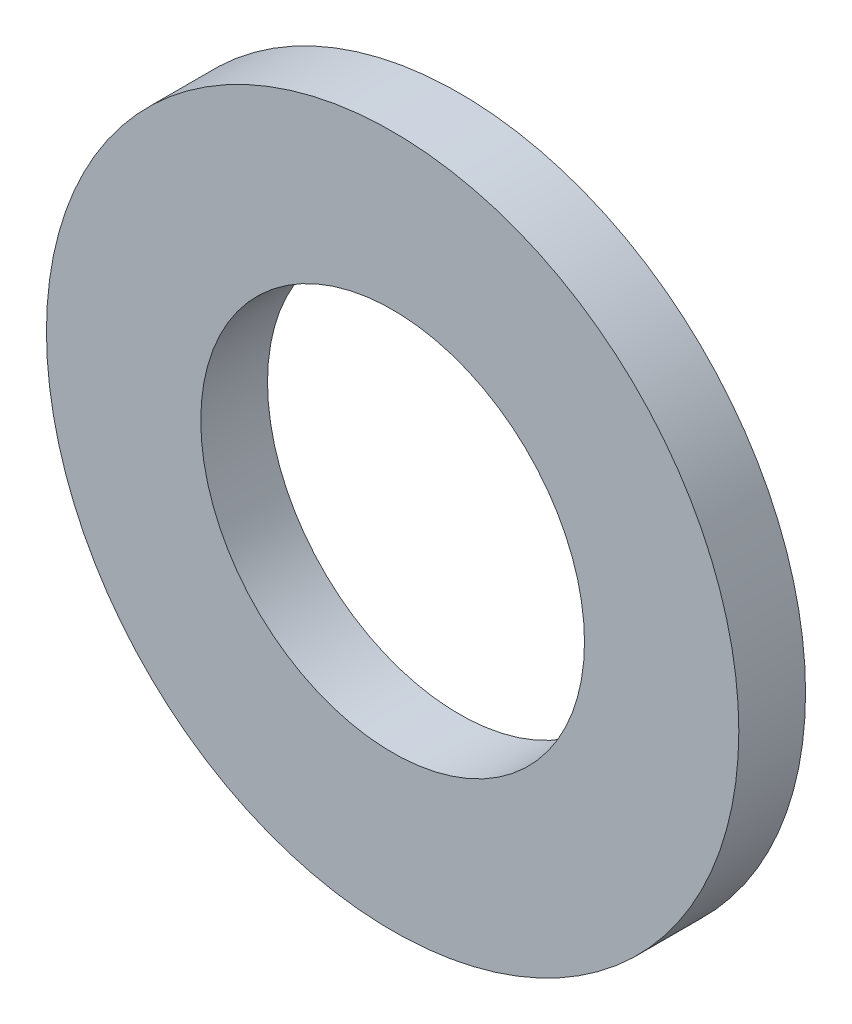
ISO-10303-21;
HEADER;
FILE_DESCRIPTION(('STEP AP214'),'2;1');
FILE_NAME('part.step','',(''),(''),'','','');
FILE_SCHEMA(('AUTOMOTIVE_DESIGN { 1 0 10303 214 1 1 1 1 }'));
ENDSEC;
DATA;
#1=APPLICATION_CONTEXT('core data for automotive mechanical design processes');
#2=APPLICATION_PROTOCOL_DEFINITION('international standard','automotive_design',2000,#1);
#3=PRODUCT_CONTEXT('',#1,'mechanical');
#4=PRODUCT('Part','Part','',(#3));
#5=PRODUCT_RELATED_PRODUCT_CATEGORY('part','',(#4));
#6=PRODUCT_DEFINITION_FORMATION('','',#4);
#7=PRODUCT_DEFINITION_CONTEXT('part definition',#1,'design');
#8=PRODUCT_DEFINITION('design','',#6,#7);
#9=PRODUCT_DEFINITION_SHAPE('','',#8);
#10=(LENGTH_UNIT() NAMED_UNIT(*) SI_UNIT(.MILLI.,.METRE.));
#11=(NAMED_UNIT(*) PLANE_ANGLE_UNIT() SI_UNIT($,.RADIAN.));
#12=(NAMED_UNIT(*) SI_UNIT($,.STERADIAN.) SOLID_ANGLE_UNIT());
#13=UNCERTAINTY_MEASURE_WITH_UNIT(LENGTH_MEASURE(1.E-05),#10,'distance_accuracy_value','');
#14=(GEOMETRIC_REPRESENTATION_CONTEXT(3) GLOBAL_UNCERTAINTY_ASSIGNED_CONTEXT((#13)) GLOBAL_UNIT_ASSIGNED_CONTEXT((#10,
#11,#12)) REPRESENTATION_CONTEXT('',''));
#15=CARTESIAN_POINT('',(0.,0.,0.));
#16=DIRECTION('',(0.,0.,1.));
#17=DIRECTION('',(1.,0.,0.));
#18=AXIS2_PLACEMENT_3D('',#15,#16,#17);
#19=CARTESIAN_POINT('',(0.,0.,1.6));
#20=DIRECTION('',(0.,0.,1.));
#21=DIRECTION('',(1.,0.,0.));
#22=AXIS2_PLACEMENT_3D('',#19,#20,#21);
#23=PLANE('',#22);
#24=CARTESIAN_POINT('',(0.,0.,1.6));
#25=DIRECTION('',(0.,0.,1.));
#26=DIRECTION('',(1.,0.,0.));
#27=AXIS2_PLACEMENT_3D('',#24,#25,#26);
#28=CIRCLE('',#27,8.3);
#29=CARTESIAN_POINT('',(8.3,0.,1.6));
#30=VERTEX_POINT('',#29);
#31=EDGE_CURVE('E11',#30,#30,#28,.T.);
#32=ORIENTED_EDGE('',*,*,#31,.T.);
#33=EDGE_LOOP('',(#32));
#34=FACE_BOUND('',#33,.T.);
#35=CARTESIAN_POINT('',(0.,0.,1.6));
#36=DIRECTION('',(0.,0.,1.));
#37=DIRECTION('',(1.,0.,0.));
#38=AXIS2_PLACEMENT_3D('',#35,#36,#37);
#39=CIRCLE('',#38,4.6);
#40=CARTESIAN_POINT('',(4.6,0.,1.6));
#41=VERTEX_POINT('',#40);
#42=EDGE_CURVE('E48',#41,#41,#39,.T.);
#43=ORIENTED_EDGE('',*,*,#42,.F.);
#44=EDGE_LOOP('',(#43));
#45=FACE_BOUND('',#44,.T.);
#46=ADVANCED_FACE('F37',(#34,#45),#23,.T.);
#47=CARTESIAN_POINT('',(0.,0.,0.));
#48=DIRECTION('',(0.,0.,1.));
#49=DIRECTION('',(1.,0.,0.));
#50=AXIS2_PLACEMENT_3D('',#47,#48,#49);
#51=PLANE('',#50);
#52=CARTESIAN_POINT('',(0.,0.,0.));
#53=DIRECTION('',(0.,0.,1.));
#54=DIRECTION('',(1.,0.,0.));
#55=AXIS2_PLACEMENT_3D('',#52,#53,#54);
#56=CIRCLE('',#55,8.3);
#57=CARTESIAN_POINT('',(8.3,0.,0.));
#58=VERTEX_POINT('',#57);
#59=EDGE_CURVE('E41',#58,#58,#56,.T.);
#60=ORIENTED_EDGE('',*,*,#59,.F.);
#61=EDGE_LOOP('',(#60));
#62=FACE_BOUND('',#61,.T.);
#63=CARTESIAN_POINT('',(0.,0.,0.));
#64=DIRECTION('',(0.,0.,1.));
#65=DIRECTION('',(1.,0.,0.));
#66=AXIS2_PLACEMENT_3D('',#63,#64,#65);
#67=CIRCLE('',#66,4.6);
#68=CARTESIAN_POINT('',(4.6,0.,0.));
#69=VERTEX_POINT('',#68);
#70=EDGE_CURVE('E50',#69,#69,#67,.T.);
#71=ORIENTED_EDGE('',*,*,#70,.T.);
#72=EDGE_LOOP('',(#71));
#73=FACE_BOUND('',#72,.T.);
#74=ADVANCED_FACE('F60',(#62,#73),#51,.F.);
#75=CARTESIAN_POINT('',(0.,0.,1.6));
#76=DIRECTION('',(0.,0.,-1.));
#77=DIRECTION('',(-1.,0.,0.));
#78=AXIS2_PLACEMENT_3D('',#75,#76,#77);
#79=CYLINDRICAL_SURFACE('',#78,8.3);
#80=ORIENTED_EDGE('',*,*,#31,.F.);
#81=EDGE_LOOP('',(#80));
#82=FACE_BOUND('',#81,.T.);
#83=ORIENTED_EDGE('',*,*,#59,.T.);
#84=EDGE_LOOP('',(#83));
#85=FACE_BOUND('',#84,.T.);
#86=ADVANCED_FACE('F39',(#82,#85),#79,.T.);
#87=CARTESIAN_POINT('',(0.,0.,1.6));
#88=DIRECTION('',(0.,0.,-1.));
#89=DIRECTION('',(-1.,0.,0.));
#90=AXIS2_PLACEMENT_3D('',#87,#88,#89);
#91=CYLINDRICAL_SURFACE('',#90,4.6);
#92=ORIENTED_EDGE('',*,*,#42,.T.);
#93=EDGE_LOOP('',(#92));
#94=FACE_BOUND('',#93,.T.);
#95=ORIENTED_EDGE('',*,*,#70,.F.);
#96=EDGE_LOOP('',(#95));
#97=FACE_BOUND('',#96,.T.);
#98=ADVANCED_FACE('F56',(#94,#97),#91,.F.);
#99=CLOSED_SHELL('',(#46,#74,#86,#98));
#100=MANIFOLD_SOLID_BREP('B2',#99);
#101=ADVANCED_BREP_SHAPE_REPRESENTATION('',(#18,#100),#14);
#102=SHAPE_DEFINITION_REPRESENTATION(#9,#101);
ENDSEC;
END-ISO-10303-21;
